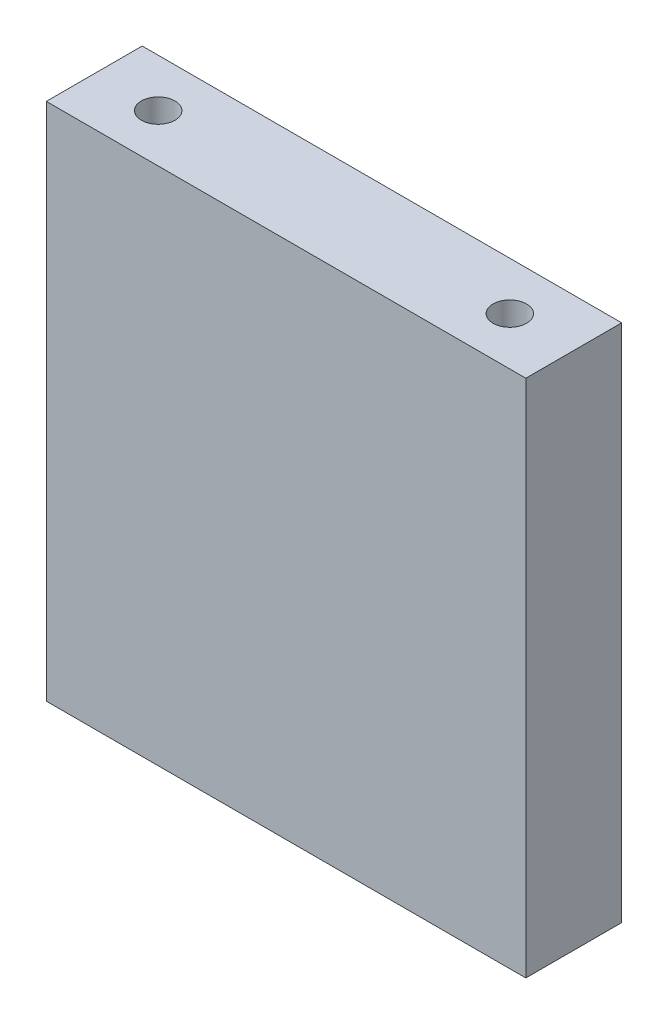
ISO-10303-21;
HEADER;
FILE_DESCRIPTION(('STEP AP214'),'2;1');
FILE_NAME('part.step','',(''),(''),'','','');
FILE_SCHEMA(('AUTOMOTIVE_DESIGN { 1 0 10303 214 1 1 1 1 }'));
ENDSEC;
DATA;
#1=APPLICATION_CONTEXT('core data for automotive mechanical design processes');
#2=APPLICATION_PROTOCOL_DEFINITION('international standard','automotive_design',2000,#1);
#3=PRODUCT_CONTEXT('',#1,'mechanical');
#4=PRODUCT('Part','Part','',(#3));
#5=PRODUCT_RELATED_PRODUCT_CATEGORY('part','',(#4));
#6=PRODUCT_DEFINITION_FORMATION('','',#4);
#7=PRODUCT_DEFINITION_CONTEXT('part definition',#1,'design');
#8=PRODUCT_DEFINITION('design','',#6,#7);
#9=PRODUCT_DEFINITION_SHAPE('','',#8);
#10=(LENGTH_UNIT() NAMED_UNIT(*) SI_UNIT(.MILLI.,.METRE.));
#11=(NAMED_UNIT(*) PLANE_ANGLE_UNIT() SI_UNIT($,.RADIAN.));
#12=(NAMED_UNIT(*) SI_UNIT($,.STERADIAN.) SOLID_ANGLE_UNIT());
#13=UNCERTAINTY_MEASURE_WITH_UNIT(LENGTH_MEASURE(1.E-05),#10,'distance_accuracy_value','');
#14=(GEOMETRIC_REPRESENTATION_CONTEXT(3) GLOBAL_UNCERTAINTY_ASSIGNED_CONTEXT((#13)) GLOBAL_UNIT_ASSIGNED_CONTEXT((#10,
#11,#12)) REPRESENTATION_CONTEXT('',''));
#15=CARTESIAN_POINT('',(0.,0.,0.));
#16=DIRECTION('',(0.,0.,1.));
#17=DIRECTION('',(1.,0.,0.));
#18=AXIS2_PLACEMENT_3D('',#15,#16,#17);
#19=CARTESIAN_POINT('',(0.,0.,12.));
#20=DIRECTION('',(1.,0.,0.));
#21=DIRECTION('',(0.,0.,-1.));
#22=AXIS2_PLACEMENT_3D('',#19,#20,#21);
#23=PLANE('',#22);
#24=DIRECTION('',(0.,-1.,0.));
#25=VECTOR('',#24,1.);
#26=CARTESIAN_POINT('',(0.,0.,0.));
#27=LINE('',#26,#25);
#28=CARTESIAN_POINT('',(0.,65.,0.));
#29=VERTEX_POINT('',#28);
#30=CARTESIAN_POINT('',(0.,0.,0.));
#31=VERTEX_POINT('',#30);
#32=EDGE_CURVE('E125',#29,#31,#27,.T.);
#33=ORIENTED_EDGE('',*,*,#32,.T.);
#34=DIRECTION('',(0.,0.,-1.));
#35=VECTOR('',#34,1.);
#36=CARTESIAN_POINT('',(0.,0.,12.));
#37=LINE('',#36,#35);
#38=CARTESIAN_POINT('',(0.,0.,12.));
#39=VERTEX_POINT('',#38);
#40=EDGE_CURVE('E11',#39,#31,#37,.T.);
#41=ORIENTED_EDGE('',*,*,#40,.F.);
#42=DIRECTION('',(0.,-1.,0.));
#43=VECTOR('',#42,1.);
#44=CARTESIAN_POINT('',(0.,0.,12.));
#45=LINE('',#44,#43);
#46=CARTESIAN_POINT('',(0.,65.,12.));
#47=VERTEX_POINT('',#46);
#48=EDGE_CURVE('E126',#47,#39,#45,.T.);
#49=ORIENTED_EDGE('',*,*,#48,.F.);
#50=DIRECTION('',(0.,0.,-1.));
#51=VECTOR('',#50,1.);
#52=CARTESIAN_POINT('',(0.,65.,12.));
#53=LINE('',#52,#51);
#54=EDGE_CURVE('E132',#47,#29,#53,.T.);
#55=ORIENTED_EDGE('',*,*,#54,.T.);
#56=EDGE_LOOP('',(#33,#41,#49,#55));
#57=FACE_BOUND('',#56,.T.);
#58=ADVANCED_FACE('F32',(#57),#23,.F.);
#59=CARTESIAN_POINT('',(0.,0.,12.));
#60=DIRECTION('',(0.,1.,0.));
#61=DIRECTION('',(0.,0.,1.));
#62=AXIS2_PLACEMENT_3D('',#59,#60,#61);
#63=PLANE('',#62);
#64=CARTESIAN_POINT('',(52.,0.,6.));
#65=DIRECTION('',(0.,-1.,0.));
#66=DIRECTION('',(0.,0.,-1.));
#67=AXIS2_PLACEMENT_3D('',#64,#65,#66);
#68=CIRCLE('',#67,2.1);
#69=CARTESIAN_POINT('',(52.,0.,3.90000000000001));
#70=VERTEX_POINT('',#69);
#71=EDGE_CURVE('E103',#70,#70,#68,.T.);
#72=ORIENTED_EDGE('',*,*,#71,.F.);
#73=EDGE_LOOP('',(#72));
#74=FACE_BOUND('',#73,.T.);
#75=CARTESIAN_POINT('',(8.,0.,6.));
#76=DIRECTION('',(0.,-1.,0.));
#77=DIRECTION('',(0.,0.,-1.));
#78=AXIS2_PLACEMENT_3D('',#75,#76,#77);
#79=CIRCLE('',#78,2.1);
#80=CARTESIAN_POINT('',(8.,0.,3.9));
#81=VERTEX_POINT('',#80);
#82=EDGE_CURVE('E102',#81,#81,#79,.T.);
#83=ORIENTED_EDGE('',*,*,#82,.F.);
#84=EDGE_LOOP('',(#83));
#85=FACE_BOUND('',#84,.T.);
#86=DIRECTION('',(1.,0.,0.));
#87=VECTOR('',#86,1.);
#88=CARTESIAN_POINT('',(0.,0.,0.));
#89=LINE('',#88,#87);
#90=CARTESIAN_POINT('',(60.,0.,0.));
#91=VERTEX_POINT('',#90);
#92=EDGE_CURVE('E135',#31,#91,#89,.T.);
#93=ORIENTED_EDGE('',*,*,#92,.T.);
#94=DIRECTION('',(0.,0.,-1.));
#95=VECTOR('',#94,1.);
#96=CARTESIAN_POINT('',(60.,0.,12.));
#97=LINE('',#96,#95);
#98=CARTESIAN_POINT('',(60.,0.,12.));
#99=VERTEX_POINT('',#98);
#100=EDGE_CURVE('E40',#99,#91,#97,.T.);
#101=ORIENTED_EDGE('',*,*,#100,.F.);
#102=DIRECTION('',(1.,0.,0.));
#103=VECTOR('',#102,1.);
#104=CARTESIAN_POINT('',(0.,0.,12.));
#105=LINE('',#104,#103);
#106=EDGE_CURVE('E79',#39,#99,#105,.T.);
#107=ORIENTED_EDGE('',*,*,#106,.F.);
#108=ORIENTED_EDGE('',*,*,#40,.T.);
#109=EDGE_LOOP('',(#93,#101,#107,#108));
#110=FACE_BOUND('',#109,.T.);
#111=ADVANCED_FACE('F159',(#74,#85,#110),#63,.F.);
#112=CARTESIAN_POINT('',(60.,0.,12.));
#113=DIRECTION('',(-1.,0.,0.));
#114=DIRECTION('',(0.,0.,1.));
#115=AXIS2_PLACEMENT_3D('',#112,#113,#114);
#116=PLANE('',#115);
#117=DIRECTION('',(0.,1.,0.));
#118=VECTOR('',#117,1.);
#119=CARTESIAN_POINT('',(60.,0.,0.));
#120=LINE('',#119,#118);
#121=CARTESIAN_POINT('',(60.,65.,0.));
#122=VERTEX_POINT('',#121);
#123=EDGE_CURVE('E66',#91,#122,#120,.T.);
#124=ORIENTED_EDGE('',*,*,#123,.T.);
#125=DIRECTION('',(0.,0.,-1.));
#126=VECTOR('',#125,1.);
#127=CARTESIAN_POINT('',(60.,65.,12.));
#128=LINE('',#127,#126);
#129=CARTESIAN_POINT('',(60.,65.,12.));
#130=VERTEX_POINT('',#129);
#131=EDGE_CURVE('E140',#130,#122,#128,.T.);
#132=ORIENTED_EDGE('',*,*,#131,.F.);
#133=DIRECTION('',(0.,1.,0.));
#134=VECTOR('',#133,1.);
#135=CARTESIAN_POINT('',(60.,0.,12.));
#136=LINE('',#135,#134);
#137=EDGE_CURVE('E129',#99,#130,#136,.T.);
#138=ORIENTED_EDGE('',*,*,#137,.F.);
#139=ORIENTED_EDGE('',*,*,#100,.T.);
#140=EDGE_LOOP('',(#124,#132,#138,#139));
#141=FACE_BOUND('',#140,.T.);
#142=ADVANCED_FACE('F142',(#141),#116,.F.);
#143=CARTESIAN_POINT('',(0.,65.,12.));
#144=DIRECTION('',(0.,-1.,0.));
#145=DIRECTION('',(0.,0.,-1.));
#146=AXIS2_PLACEMENT_3D('',#143,#144,#145);
#147=PLANE('',#146);
#148=CARTESIAN_POINT('',(52.,65.,6.));
#149=DIRECTION('',(0.,1.,0.));
#150=DIRECTION('',(0.,0.,1.));
#151=AXIS2_PLACEMENT_3D('',#148,#149,#150);
#152=CIRCLE('',#151,2.1);
#153=CARTESIAN_POINT('',(52.,65.,8.1));
#154=VERTEX_POINT('',#153);
#155=EDGE_CURVE('E113',#154,#154,#152,.T.);
#156=ORIENTED_EDGE('',*,*,#155,.F.);
#157=EDGE_LOOP('',(#156));
#158=FACE_BOUND('',#157,.T.);
#159=CARTESIAN_POINT('',(8.,65.,6.));
#160=DIRECTION('',(0.,1.,0.));
#161=DIRECTION('',(0.,0.,1.));
#162=AXIS2_PLACEMENT_3D('',#159,#160,#161);
#163=CIRCLE('',#162,2.1);
#164=CARTESIAN_POINT('',(8.,65.,8.1));
#165=VERTEX_POINT('',#164);
#166=EDGE_CURVE('E119',#165,#165,#163,.T.);
#167=ORIENTED_EDGE('',*,*,#166,.F.);
#168=EDGE_LOOP('',(#167));
#169=FACE_BOUND('',#168,.T.);
#170=DIRECTION('',(-1.,0.,0.));
#171=VECTOR('',#170,1.);
#172=CARTESIAN_POINT('',(0.,65.,0.));
#173=LINE('',#172,#171);
#174=EDGE_CURVE('E72',#122,#29,#173,.T.);
#175=ORIENTED_EDGE('',*,*,#174,.T.);
#176=ORIENTED_EDGE('',*,*,#54,.F.);
#177=DIRECTION('',(-1.,0.,0.));
#178=VECTOR('',#177,1.);
#179=CARTESIAN_POINT('',(0.,65.,12.));
#180=LINE('',#179,#178);
#181=EDGE_CURVE('E48',#130,#47,#180,.T.);
#182=ORIENTED_EDGE('',*,*,#181,.F.);
#183=ORIENTED_EDGE('',*,*,#131,.T.);
#184=EDGE_LOOP('',(#175,#176,#182,#183));
#185=FACE_BOUND('',#184,.T.);
#186=ADVANCED_FACE('F149',(#158,#169,#185),#147,.F.);
#187=CARTESIAN_POINT('',(0.,65.,12.));
#188=DIRECTION('',(0.,0.,-1.));
#189=DIRECTION('',(-1.,0.,0.));
#190=AXIS2_PLACEMENT_3D('',#187,#188,#189);
#191=PLANE('',#190);
#192=ORIENTED_EDGE('',*,*,#48,.T.);
#193=ORIENTED_EDGE('',*,*,#106,.T.);
#194=ORIENTED_EDGE('',*,*,#137,.T.);
#195=ORIENTED_EDGE('',*,*,#181,.T.);
#196=EDGE_LOOP('',(#192,#193,#194,#195));
#197=FACE_BOUND('',#196,.T.);
#198=ADVANCED_FACE('F151',(#197),#191,.F.);
#199=CARTESIAN_POINT('',(0.,65.,0.));
#200=DIRECTION('',(0.,0.,-1.));
#201=DIRECTION('',(-1.,0.,0.));
#202=AXIS2_PLACEMENT_3D('',#199,#200,#201);
#203=PLANE('',#202);
#204=ORIENTED_EDGE('',*,*,#32,.F.);
#205=ORIENTED_EDGE('',*,*,#174,.F.);
#206=ORIENTED_EDGE('',*,*,#123,.F.);
#207=ORIENTED_EDGE('',*,*,#92,.F.);
#208=EDGE_LOOP('',(#204,#205,#206,#207));
#209=FACE_BOUND('',#208,.T.);
#210=ADVANCED_FACE('F145',(#209),#203,.T.);
#211=CARTESIAN_POINT('',(8.,51.,6.));
#212=DIRECTION('',(0.,1.,0.));
#213=DIRECTION('',(0.,0.,1.));
#214=AXIS2_PLACEMENT_3D('',#211,#212,#213);
#215=CONICAL_SURFACE('',#214,2.1,1.02974425867665);
#216=CARTESIAN_POINT('',(8.,49.7381927000421,6.));
#217=VERTEX_POINT('',#216);
#218=VERTEX_LOOP('',#217);
#219=FACE_BOUND('',#218,.T.);
#220=CARTESIAN_POINT('',(8.,51.,6.));
#221=DIRECTION('',(0.,1.,0.));
#222=DIRECTION('',(0.,0.,1.));
#223=AXIS2_PLACEMENT_3D('',#220,#221,#222);
#224=CIRCLE('',#223,2.1);
#225=CARTESIAN_POINT('',(8.,51.,8.1));
#226=VERTEX_POINT('',#225);
#227=EDGE_CURVE('E122',#226,#226,#224,.T.);
#228=ORIENTED_EDGE('',*,*,#227,.T.);
#229=EDGE_LOOP('',(#228));
#230=FACE_BOUND('',#229,.T.);
#231=ADVANCED_FACE('F198',(#219,#230),#215,.F.);
#232=CARTESIAN_POINT('',(8.,65.,6.));
#233=DIRECTION('',(0.,1.,0.));
#234=DIRECTION('',(0.,0.,1.));
#235=AXIS2_PLACEMENT_3D('',#232,#233,#234);
#236=CYLINDRICAL_SURFACE('',#235,2.1);
#237=ORIENTED_EDGE('',*,*,#227,.F.);
#238=EDGE_LOOP('',(#237));
#239=FACE_BOUND('',#238,.T.);
#240=ORIENTED_EDGE('',*,*,#166,.T.);
#241=EDGE_LOOP('',(#240));
#242=FACE_BOUND('',#241,.T.);
#243=ADVANCED_FACE('F194',(#239,#242),#236,.F.);
#244=CARTESIAN_POINT('',(52.,51.,6.));
#245=DIRECTION('',(0.,1.,0.));
#246=DIRECTION('',(0.,0.,1.));
#247=AXIS2_PLACEMENT_3D('',#244,#245,#246);
#248=CONICAL_SURFACE('',#247,2.1,1.02974425867665);
#249=CARTESIAN_POINT('',(52.,49.7381927000421,6.));
#250=VERTEX_POINT('',#249);
#251=VERTEX_LOOP('',#250);
#252=FACE_BOUND('',#251,.T.);
#253=CARTESIAN_POINT('',(52.,51.,6.));
#254=DIRECTION('',(0.,1.,0.));
#255=DIRECTION('',(0.,0.,1.));
#256=AXIS2_PLACEMENT_3D('',#253,#254,#255);
#257=CIRCLE('',#256,2.1);
#258=CARTESIAN_POINT('',(52.,51.,8.1));
#259=VERTEX_POINT('',#258);
#260=EDGE_CURVE('E116',#259,#259,#257,.T.);
#261=ORIENTED_EDGE('',*,*,#260,.T.);
#262=EDGE_LOOP('',(#261));
#263=FACE_BOUND('',#262,.T.);
#264=ADVANCED_FACE('F190',(#252,#263),#248,.F.);
#265=CARTESIAN_POINT('',(52.,65.,6.));
#266=DIRECTION('',(0.,1.,0.));
#267=DIRECTION('',(0.,0.,1.));
#268=AXIS2_PLACEMENT_3D('',#265,#266,#267);
#269=CYLINDRICAL_SURFACE('',#268,2.1);
#270=ORIENTED_EDGE('',*,*,#260,.F.);
#271=EDGE_LOOP('',(#270));
#272=FACE_BOUND('',#271,.T.);
#273=ORIENTED_EDGE('',*,*,#155,.T.);
#274=EDGE_LOOP('',(#273));
#275=FACE_BOUND('',#274,.T.);
#276=ADVANCED_FACE('F182',(#272,#275),#269,.F.);
#277=CARTESIAN_POINT('',(8.,14.,6.));
#278=DIRECTION('',(0.,-1.,0.));
#279=DIRECTION('',(0.,0.,-1.));
#280=AXIS2_PLACEMENT_3D('',#277,#278,#279);
#281=CONICAL_SURFACE('',#280,2.1,1.02974425867665);
#282=CARTESIAN_POINT('',(8.,15.2618072999579,6.));
#283=VERTEX_POINT('',#282);
#284=VERTEX_LOOP('',#283);
#285=FACE_BOUND('',#284,.T.);
#286=CARTESIAN_POINT('',(8.,14.,6.));
#287=DIRECTION('',(0.,-1.,0.));
#288=DIRECTION('',(0.,0.,-1.));
#289=AXIS2_PLACEMENT_3D('',#286,#287,#288);
#290=CIRCLE('',#289,2.1);
#291=CARTESIAN_POINT('',(8.,14.,3.90000000000001));
#292=VERTEX_POINT('',#291);
#293=EDGE_CURVE('E106',#292,#292,#290,.T.);
#294=ORIENTED_EDGE('',*,*,#293,.T.);
#295=EDGE_LOOP('',(#294));
#296=FACE_BOUND('',#295,.T.);
#297=ADVANCED_FACE('F176',(#285,#296),#281,.F.);
#298=CARTESIAN_POINT('',(8.,0.,6.));
#299=DIRECTION('',(0.,-1.,0.));
#300=DIRECTION('',(0.,0.,-1.));
#301=AXIS2_PLACEMENT_3D('',#298,#299,#300);
#302=CYLINDRICAL_SURFACE('',#301,2.1);
#303=ORIENTED_EDGE('',*,*,#293,.F.);
#304=EDGE_LOOP('',(#303));
#305=FACE_BOUND('',#304,.T.);
#306=ORIENTED_EDGE('',*,*,#82,.T.);
#307=EDGE_LOOP('',(#306));
#308=FACE_BOUND('',#307,.T.);
#309=ADVANCED_FACE('F96',(#305,#308),#302,.F.);
#310=CARTESIAN_POINT('',(52.,14.,6.));
#311=DIRECTION('',(0.,-1.,0.));
#312=DIRECTION('',(0.,0.,-1.));
#313=AXIS2_PLACEMENT_3D('',#310,#311,#312);
#314=CONICAL_SURFACE('',#313,2.1,1.02974425867665);
#315=CARTESIAN_POINT('',(52.,15.2618072999579,6.));
#316=VERTEX_POINT('',#315);
#317=VERTEX_LOOP('',#316);
#318=FACE_BOUND('',#317,.T.);
#319=CARTESIAN_POINT('',(52.,14.,6.));
#320=DIRECTION('',(0.,-1.,0.));
#321=DIRECTION('',(0.,0.,-1.));
#322=AXIS2_PLACEMENT_3D('',#319,#320,#321);
#323=CIRCLE('',#322,2.1);
#324=CARTESIAN_POINT('',(52.,14.,3.90000000000001));
#325=VERTEX_POINT('',#324);
#326=EDGE_CURVE('E100',#325,#325,#323,.T.);
#327=ORIENTED_EDGE('',*,*,#326,.T.);
#328=EDGE_LOOP('',(#327));
#329=FACE_BOUND('',#328,.T.);
#330=ADVANCED_FACE('F92',(#318,#329),#314,.F.);
#331=CARTESIAN_POINT('',(52.,0.,6.));
#332=DIRECTION('',(0.,-1.,0.));
#333=DIRECTION('',(0.,0.,-1.));
#334=AXIS2_PLACEMENT_3D('',#331,#332,#333);
#335=CYLINDRICAL_SURFACE('',#334,2.1);
#336=ORIENTED_EDGE('',*,*,#326,.F.);
#337=EDGE_LOOP('',(#336));
#338=FACE_BOUND('',#337,.T.);
#339=ORIENTED_EDGE('',*,*,#71,.T.);
#340=EDGE_LOOP('',(#339));
#341=FACE_BOUND('',#340,.T.);
#342=ADVANCED_FACE('F95',(#338,#341),#335,.F.);
#343=CLOSED_SHELL('',(#58,#111,#142,#186,#198,#210,#231,#243,#264,#276,#297,#309,#330,#342));
#344=MANIFOLD_SOLID_BREP('B2',#343);
#345=ADVANCED_BREP_SHAPE_REPRESENTATION('',(#18,#344),#14);
#346=SHAPE_DEFINITION_REPRESENTATION(#9,#345);
ENDSEC;
END-ISO-10303-21;
